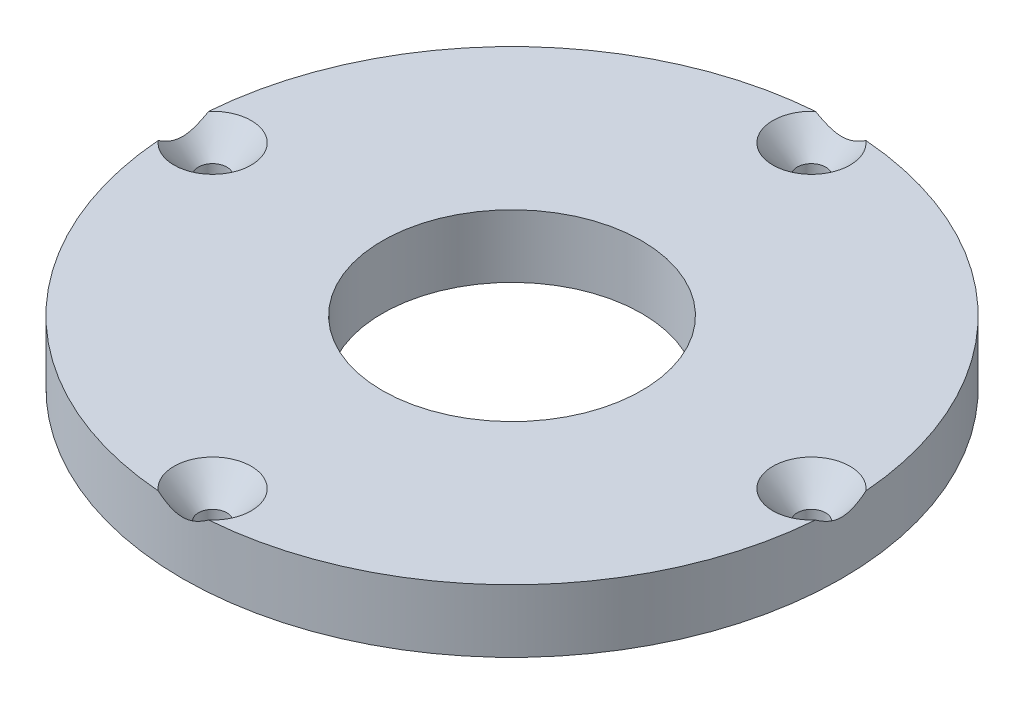
ISO-10303-21;
HEADER;
FILE_DESCRIPTION(('STEP AP214'),'2;1');
FILE_NAME('part.step','',(''),(''),'','','');
FILE_SCHEMA(('AUTOMOTIVE_DESIGN { 1 0 10303 214 1 1 1 1 }'));
ENDSEC;
DATA;
#1=APPLICATION_CONTEXT('core data for automotive mechanical design processes');
#2=APPLICATION_PROTOCOL_DEFINITION('international standard','automotive_design',2000,#1);
#3=PRODUCT_CONTEXT('',#1,'mechanical');
#4=PRODUCT('Part','Part','',(#3));
#5=PRODUCT_RELATED_PRODUCT_CATEGORY('part','',(#4));
#6=PRODUCT_DEFINITION_FORMATION('','',#4);
#7=PRODUCT_DEFINITION_CONTEXT('part definition',#1,'design');
#8=PRODUCT_DEFINITION('design','',#6,#7);
#9=PRODUCT_DEFINITION_SHAPE('','',#8);
#10=(LENGTH_UNIT() NAMED_UNIT(*) SI_UNIT(.MILLI.,.METRE.));
#11=(NAMED_UNIT(*) PLANE_ANGLE_UNIT() SI_UNIT($,.RADIAN.));
#12=(NAMED_UNIT(*) SI_UNIT($,.STERADIAN.) SOLID_ANGLE_UNIT());
#13=UNCERTAINTY_MEASURE_WITH_UNIT(LENGTH_MEASURE(1.E-05),#10,'distance_accuracy_value','');
#14=(GEOMETRIC_REPRESENTATION_CONTEXT(3) GLOBAL_UNCERTAINTY_ASSIGNED_CONTEXT((#13)) GLOBAL_UNIT_ASSIGNED_CONTEXT((#10,
#11,#12)) REPRESENTATION_CONTEXT('',''));
#15=CARTESIAN_POINT('',(0.,0.,0.));
#16=DIRECTION('',(0.,0.,1.));
#17=DIRECTION('',(1.,0.,0.));
#18=AXIS2_PLACEMENT_3D('',#15,#16,#17);
#19=CARTESIAN_POINT('',(0.,6.35,0.));
#20=DIRECTION('',(0.,-1.,0.));
#21=DIRECTION('',(0.,0.,-1.));
#22=AXIS2_PLACEMENT_3D('',#19,#20,#21);
#23=CYLINDRICAL_SURFACE('',#22,33.274);
#24=CARTESIAN_POINT('',(0.,6.35,0.));
#25=DIRECTION('',(0.,1.,0.));
#26=DIRECTION('',(0.,0.,1.));
#27=AXIS2_PLACEMENT_3D('',#24,#25,#26);
#28=CIRCLE('',#27,33.274);
#29=CARTESIAN_POINT('',(-33.1762180042017,6.35,2.5490458877165));
#30=VERTEX_POINT('',#29);
#31=CARTESIAN_POINT('',(-2.54904588771647,6.35,33.1762180042017));
#32=VERTEX_POINT('',#31);
#33=EDGE_CURVE('E66',#30,#32,#28,.T.);
#34=ORIENTED_EDGE('',*,*,#33,.F.);
#35=CARTESIAN_POINT('',(-33.1761955775648,6.3502,2.54933775698086));
#36=CARTESIAN_POINT('',(-33.1805825798049,6.31107939084975,2.49224353407827));
#37=CARTESIAN_POINT('',(-33.1848510304405,6.27250049597728,2.43476969254307));
#38=CARTESIAN_POINT('',(-33.1931441576657,6.19658644675497,2.31897186656584));
#39=CARTESIAN_POINT('',(-33.1971687808717,6.15925156556883,2.26064769939652));
#40=CARTESIAN_POINT('',(-33.2088943013344,6.04909511512583,2.08384553223999));
#41=CARTESIAN_POINT('',(-33.21621273273,5.97842751075451,1.96397900073564));
#42=CARTESIAN_POINT('',(-33.2299267423548,5.84287264009969,1.71662751721354));
#43=CARTESIAN_POINT('',(-33.2362915352426,5.77819684433707,1.58902380768307));
#44=CARTESIAN_POINT('',(-33.2477056933444,5.65973625813034,1.32892352336059));
#45=CARTESIAN_POINT('',(-33.252757166911,5.60593404296546,1.19643518556831));
#46=CARTESIAN_POINT('',(-33.2597607527403,5.53010959344534,0.97700011371498));
#47=CARTESIAN_POINT('',(-33.2621651774734,5.50373063278104,0.89157391111778));
#48=CARTESIAN_POINT('',(-33.2663443566313,5.45749882873885,0.718930100382252));
#49=CARTESIAN_POINT('',(-33.2681190973177,5.4376461277508,0.631712453202316));
#50=CARTESIAN_POINT('',(-33.2709765493234,5.40551094726472,0.456890129599175));
#51=CARTESIAN_POINT('',(-33.2720668907164,5.39314505771044,0.369301096688978));
#52=CARTESIAN_POINT('',(-33.2735544176201,5.3762413742042,0.193361047117015));
#53=CARTESIAN_POINT('',(-33.2739516632509,5.37170290129143,0.105010097213176));
#54=CARTESIAN_POINT('',(-33.2740401673081,5.37069333829633,-0.0720342768338496));
#55=CARTESIAN_POINT('',(-33.2737290643389,5.37424923209352,-0.160727859594178));
#56=CARTESIAN_POINT('',(-33.2724063706862,5.38929227282091,-0.337431416023773));
#57=CARTESIAN_POINT('',(-33.2713947189189,5.40078011136885,-0.425441329404433));
#58=CARTESIAN_POINT('',(-33.2686862677066,5.43128710485559,-0.601168319089554));
#59=CARTESIAN_POINT('',(-33.2669816807199,5.45039181327727,-0.688870240584589));
#60=CARTESIAN_POINT('',(-33.2629329615701,5.49527694915702,-0.862503889061059));
#61=CARTESIAN_POINT('',(-33.2605888461569,5.52105720177418,-0.94843566234128));
#62=CARTESIAN_POINT('',(-33.2536703765143,5.59615482408612,-1.17109467674494));
#63=CARTESIAN_POINT('',(-33.2486149947613,5.65014727225309,-1.30623006374369));
#64=CARTESIAN_POINT('',(-33.2371376661082,5.76954580051192,-1.5714421316998));
#65=CARTESIAN_POINT('',(-33.2307133355823,5.83497175250638,-1.70150951482053));
#66=CARTESIAN_POINT('',(-33.2168373397957,5.97236435376283,-1.9535315600519));
#67=CARTESIAN_POINT('',(-33.2094177537716,6.04410921552668,-2.07561016696838));
#68=CARTESIAN_POINT('',(-33.1975139212334,6.15604068896211,-2.25560127653234));
#69=CARTESIAN_POINT('',(-33.1934262548253,6.19398636529059,-2.3149562707655));
#70=CARTESIAN_POINT('',(-33.1849984365551,6.27116810514676,-2.43278419120686));
#71=CARTESIAN_POINT('',(-33.1806583435334,6.31040386703801,-2.49125731900659));
#72=CARTESIAN_POINT('',(-33.1761955775648,6.3502,-2.54933775698086));
#73=B_SPLINE_CURVE_WITH_KNOTS('',3,(#35,#36,#37,#38,#39,#40,#41,#42,#43,#44,#45,#46,#47,#48,#49,
#50,#51,#52,#53,#54,#55,#56,#57,#58,#59,#60,#61,#62,#63,#64,#65,#66,#67,#68,#69,#70,#71,#72),
.UNSPECIFIED.,.F.,.F.,(4,2,2,2,2,2,2,2,2,2,2,2,2,2,2,2,2,2,4),(0.,0.208043349461832,
0.416132084531599,0.833921512402195,1.26315987875748,1.69170484689115,1.95980491509329,
2.22791083231083,2.49297203327847,2.75801024131868,3.02393329047978,3.28987952945598,
3.55890108157153,3.82791558838638,4.26397379238092,4.70079756122368,5.12593596847389,
5.33762144708327,5.54925777837407),.UNSPECIFIED.);
#74=CARTESIAN_POINT('',(-33.1762180042017,6.35,-2.54904588771648));
#75=VERTEX_POINT('',#74);
#76=EDGE_CURVE('E11',#30,#75,#73,.T.);
#77=ORIENTED_EDGE('',*,*,#76,.T.);
#78=CARTESIAN_POINT('',(-2.5490458877165,6.35,-33.1762180042017));
#79=VERTEX_POINT('',#78);
#80=EDGE_CURVE('E90',#79,#75,#28,.T.);
#81=ORIENTED_EDGE('',*,*,#80,.F.);
#82=CARTESIAN_POINT('',(-2.54933775698085,6.3502,-33.1761955775648));
#83=CARTESIAN_POINT('',(-2.49224353407827,6.31107939084975,-33.1805825798049));
#84=CARTESIAN_POINT('',(-2.43476969254307,6.27250049597728,-33.1848510304405));
#85=CARTESIAN_POINT('',(-2.31897186656584,6.19658644675497,-33.1931441576657));
#86=CARTESIAN_POINT('',(-2.26064769939652,6.15925156556883,-33.1971687808717));
#87=CARTESIAN_POINT('',(-2.08384553223999,6.04909511512584,-33.2088943013344));
#88=CARTESIAN_POINT('',(-1.96397900073564,5.97842751075451,-33.21621273273));
#89=CARTESIAN_POINT('',(-1.71662751721354,5.84287264009969,-33.2299267423548));
#90=CARTESIAN_POINT('',(-1.58902380768307,5.77819684433707,-33.2362915352426));
#91=CARTESIAN_POINT('',(-1.32892352336059,5.65973625813034,-33.2477056933444));
#92=CARTESIAN_POINT('',(-1.19643518556831,5.60593404296546,-33.252757166911));
#93=CARTESIAN_POINT('',(-0.977000113714979,5.53010959344534,-33.2597607527403));
#94=CARTESIAN_POINT('',(-0.891573911117779,5.50373063278104,-33.2621651774734));
#95=CARTESIAN_POINT('',(-0.718930100382251,5.45749882873885,-33.2663443566313));
#96=CARTESIAN_POINT('',(-0.631712453202315,5.4376461277508,-33.2681190973177));
#97=CARTESIAN_POINT('',(-0.456890129599174,5.40551094726472,-33.2709765493234));
#98=CARTESIAN_POINT('',(-0.369301096688977,5.39314505771044,-33.2720668907164));
#99=CARTESIAN_POINT('',(-0.193361047117014,5.3762413742042,-33.2735544176201));
#100=CARTESIAN_POINT('',(-0.105010097213176,5.37170290129142,-33.2739516632509));
#101=CARTESIAN_POINT('',(0.0720342768338502,5.37069333829633,-33.2740401673081));
#102=CARTESIAN_POINT('',(0.160727859594178,5.37424923209353,-33.2737290643389));
#103=CARTESIAN_POINT('',(0.337431416023774,5.38929227282091,-33.2724063706862));
#104=CARTESIAN_POINT('',(0.425441329404434,5.40078011136885,-33.2713947189189));
#105=CARTESIAN_POINT('',(0.601168319089555,5.43128710485559,-33.2686862677066));
#106=CARTESIAN_POINT('',(0.68887024058459,5.45039181327727,-33.2669816807199));
#107=CARTESIAN_POINT('',(0.86250388906106,5.49527694915702,-33.2629329615701));
#108=CARTESIAN_POINT('',(0.948435662341281,5.52105720177418,-33.2605888461569));
#109=CARTESIAN_POINT('',(1.17109467674494,5.59615482408612,-33.2536703765143));
#110=CARTESIAN_POINT('',(1.30623006374369,5.65014727225309,-33.2486149947613));
#111=CARTESIAN_POINT('',(1.5714421316998,5.76954580051192,-33.2371376661082));
#112=CARTESIAN_POINT('',(1.70150951482053,5.83497175250639,-33.2307133355823));
#113=CARTESIAN_POINT('',(1.9535315600519,5.97236435376283,-33.2168373397957));
#114=CARTESIAN_POINT('',(2.07561016696838,6.04410921552668,-33.2094177537716));
#115=CARTESIAN_POINT('',(2.25560127653234,6.15604068896211,-33.1975139212334));
#116=CARTESIAN_POINT('',(2.3149562707655,6.19398636529059,-33.1934262548253));
#117=CARTESIAN_POINT('',(2.43278419120686,6.27116810514676,-33.1849984365551));
#118=CARTESIAN_POINT('',(2.49125731900659,6.31040386703801,-33.1806583435334));
#119=CARTESIAN_POINT('',(2.54933775698085,6.3502,-33.1761955775648));
#120=B_SPLINE_CURVE_WITH_KNOTS('',3,(#82,#83,#84,#85,#86,#87,#88,#89,#90,#91,#92,#93,#94,#95,
#96,#97,#98,#99,#100,#101,#102,#103,#104,#105,#106,#107,#108,#109,#110,#111,#112,#113,#114,#115,
#116,#117,#118,#119),.UNSPECIFIED.,.F.,.F.,(4,2,2,2,2,2,2,2,2,2,2,2,2,2,2,2,2,2,4),(0.,
0.208043349461831,0.416132084531599,0.833921512402194,1.26315987875747,1.69170484689115,
1.95980491509329,2.22791083231083,2.49297203327847,2.75801024131868,3.02393329047978,
3.28987952945598,3.55890108157154,3.82791558838638,4.26397379238092,4.70079756122368,
5.12593596847389,5.33762144708327,5.54925777837407),.UNSPECIFIED.);
#121=CARTESIAN_POINT('',(2.54904588771647,6.35,-33.1762180042017));
#122=VERTEX_POINT('',#121);
#123=EDGE_CURVE('E104',#79,#122,#120,.T.);
#124=ORIENTED_EDGE('',*,*,#123,.T.);
#125=CARTESIAN_POINT('',(33.1762180042017,6.35,-2.5490458877165));
#126=VERTEX_POINT('',#125);
#127=EDGE_CURVE('E105',#126,#122,#28,.T.);
#128=ORIENTED_EDGE('',*,*,#127,.F.);
#129=CARTESIAN_POINT('',(33.1761955775648,6.3502,-2.54933775698086));
#130=CARTESIAN_POINT('',(33.1805825798049,6.31107939084975,-2.49224353407827));
#131=CARTESIAN_POINT('',(33.1848510304405,6.27250049597728,-2.43476969254307));
#132=CARTESIAN_POINT('',(33.1931441576657,6.19658644675497,-2.31897186656584));
#133=CARTESIAN_POINT('',(33.1971687808717,6.15925156556883,-2.26064769939652));
#134=CARTESIAN_POINT('',(33.2088943013344,6.04909511512583,-2.08384553223999));
#135=CARTESIAN_POINT('',(33.21621273273,5.97842751075451,-1.96397900073564));
#136=CARTESIAN_POINT('',(33.2299267423548,5.84287264009969,-1.71662751721354));
#137=CARTESIAN_POINT('',(33.2362915352426,5.77819684433707,-1.58902380768307));
#138=CARTESIAN_POINT('',(33.2477056933444,5.65973625813034,-1.32892352336059));
#139=CARTESIAN_POINT('',(33.252757166911,5.60593404296546,-1.19643518556831));
#140=CARTESIAN_POINT('',(33.2597607527403,5.53010959344534,-0.97700011371498));
#141=CARTESIAN_POINT('',(33.2621651774734,5.50373063278104,-0.89157391111778));
#142=CARTESIAN_POINT('',(33.2663443566313,5.45749882873885,-0.718930100382252));
#143=CARTESIAN_POINT('',(33.2681190973177,5.4376461277508,-0.631712453202316));
#144=CARTESIAN_POINT('',(33.2709765493234,5.40551094726472,-0.456890129599175));
#145=CARTESIAN_POINT('',(33.2720668907164,5.39314505771044,-0.369301096688978));
#146=CARTESIAN_POINT('',(33.2735544176201,5.3762413742042,-0.193361047117015));
#147=CARTESIAN_POINT('',(33.2739516632509,5.37170290129143,-0.105010097213176));
#148=CARTESIAN_POINT('',(33.2740401673081,5.37069333829633,0.0720342768338496));
#149=CARTESIAN_POINT('',(33.2737290643389,5.37424923209352,0.160727859594178));
#150=CARTESIAN_POINT('',(33.2724063706862,5.38929227282091,0.337431416023773));
#151=CARTESIAN_POINT('',(33.2713947189189,5.40078011136885,0.425441329404433));
#152=CARTESIAN_POINT('',(33.2686862677066,5.43128710485559,0.601168319089554));
#153=CARTESIAN_POINT('',(33.2669816807199,5.45039181327727,0.688870240584589));
#154=CARTESIAN_POINT('',(33.2629329615701,5.49527694915702,0.862503889061059));
#155=CARTESIAN_POINT('',(33.2605888461569,5.52105720177418,0.94843566234128));
#156=CARTESIAN_POINT('',(33.2536703765143,5.59615482408612,1.17109467674494));
#157=CARTESIAN_POINT('',(33.2486149947613,5.65014727225309,1.30623006374369));
#158=CARTESIAN_POINT('',(33.2371376661082,5.76954580051192,1.5714421316998));
#159=CARTESIAN_POINT('',(33.2307133355823,5.83497175250638,1.70150951482053));
#160=CARTESIAN_POINT('',(33.2168373397957,5.97236435376283,1.9535315600519));
#161=CARTESIAN_POINT('',(33.2094177537716,6.04410921552668,2.07561016696838));
#162=CARTESIAN_POINT('',(33.1975139212334,6.15604068896211,2.25560127653234));
#163=CARTESIAN_POINT('',(33.1934262548253,6.19398636529059,2.3149562707655));
#164=CARTESIAN_POINT('',(33.1849984365551,6.27116810514676,2.43278419120686));
#165=CARTESIAN_POINT('',(33.1806583435334,6.31040386703801,2.49125731900659));
#166=CARTESIAN_POINT('',(33.1761955775648,6.3502,2.54933775698086));
#167=B_SPLINE_CURVE_WITH_KNOTS('',3,(#129,#130,#131,#132,#133,#134,#135,#136,#137,#138,#139,
#140,#141,#142,#143,#144,#145,#146,#147,#148,#149,#150,#151,#152,#153,#154,#155,#156,#157,#158,
#159,#160,#161,#162,#163,#164,#165,#166),.UNSPECIFIED.,.F.,.F.,(4,2,2,2,2,2,2,2,2,2,2,2,2,2,2,2,
2,2,4),(0.,0.208043349461832,0.416132084531599,0.833921512402195,1.26315987875748,
1.69170484689115,1.95980491509329,2.22791083231083,2.49297203327847,2.75801024131868,
3.02393329047978,3.28987952945598,3.55890108157153,3.82791558838638,4.26397379238092,
4.70079756122368,5.12593596847389,5.33762144708327,5.54925777837407),.UNSPECIFIED.);
#168=CARTESIAN_POINT('',(33.1762180042017,6.35,2.54904588771648));
#169=VERTEX_POINT('',#168);
#170=EDGE_CURVE('E123',#126,#169,#167,.T.);
#171=ORIENTED_EDGE('',*,*,#170,.T.);
#172=CARTESIAN_POINT('',(2.5490458877165,6.35,33.1762180042017));
#173=VERTEX_POINT('',#172);
#174=EDGE_CURVE('E99',#173,#169,#28,.T.);
#175=ORIENTED_EDGE('',*,*,#174,.F.);
#176=CARTESIAN_POINT('',(2.54933775698085,6.3502,33.1761955775648));
#177=CARTESIAN_POINT('',(2.49224353407827,6.31107939084975,33.1805825798049));
#178=CARTESIAN_POINT('',(2.43476969254307,6.27250049597728,33.1848510304405));
#179=CARTESIAN_POINT('',(2.31897186656584,6.19658644675497,33.1931441576657));
#180=CARTESIAN_POINT('',(2.26064769939652,6.15925156556883,33.1971687808717));
#181=CARTESIAN_POINT('',(2.08384553223999,6.04909511512584,33.2088943013344));
#182=CARTESIAN_POINT('',(1.96397900073564,5.97842751075451,33.21621273273));
#183=CARTESIAN_POINT('',(1.71662751721354,5.84287264009969,33.2299267423548));
#184=CARTESIAN_POINT('',(1.58902380768307,5.77819684433707,33.2362915352426));
#185=CARTESIAN_POINT('',(1.32892352336059,5.65973625813034,33.2477056933444));
#186=CARTESIAN_POINT('',(1.19643518556831,5.60593404296546,33.252757166911));
#187=CARTESIAN_POINT('',(0.977000113714979,5.53010959344534,33.2597607527403));
#188=CARTESIAN_POINT('',(0.891573911117779,5.50373063278104,33.2621651774734));
#189=CARTESIAN_POINT('',(0.718930100382251,5.45749882873885,33.2663443566313));
#190=CARTESIAN_POINT('',(0.631712453202315,5.4376461277508,33.2681190973177));
#191=CARTESIAN_POINT('',(0.456890129599174,5.40551094726472,33.2709765493234));
#192=CARTESIAN_POINT('',(0.369301096688977,5.39314505771044,33.2720668907164));
#193=CARTESIAN_POINT('',(0.193361047117014,5.3762413742042,33.2735544176201));
#194=CARTESIAN_POINT('',(0.105010097213176,5.37170290129142,33.2739516632509));
#195=CARTESIAN_POINT('',(-0.0720342768338502,5.37069333829633,33.2740401673081));
#196=CARTESIAN_POINT('',(-0.160727859594178,5.37424923209353,33.2737290643389));
#197=CARTESIAN_POINT('',(-0.337431416023774,5.38929227282091,33.2724063706862));
#198=CARTESIAN_POINT('',(-0.425441329404434,5.40078011136885,33.2713947189189));
#199=CARTESIAN_POINT('',(-0.601168319089555,5.43128710485559,33.2686862677066));
#200=CARTESIAN_POINT('',(-0.68887024058459,5.45039181327727,33.2669816807199));
#201=CARTESIAN_POINT('',(-0.86250388906106,5.49527694915702,33.2629329615701));
#202=CARTESIAN_POINT('',(-0.948435662341281,5.52105720177418,33.2605888461569));
#203=CARTESIAN_POINT('',(-1.17109467674494,5.59615482408612,33.2536703765143));
#204=CARTESIAN_POINT('',(-1.30623006374369,5.65014727225309,33.2486149947613));
#205=CARTESIAN_POINT('',(-1.5714421316998,5.76954580051192,33.2371376661082));
#206=CARTESIAN_POINT('',(-1.70150951482053,5.83497175250639,33.2307133355823));
#207=CARTESIAN_POINT('',(-1.9535315600519,5.97236435376283,33.2168373397957));
#208=CARTESIAN_POINT('',(-2.07561016696838,6.04410921552668,33.2094177537716));
#209=CARTESIAN_POINT('',(-2.25560127653234,6.15604068896211,33.1975139212334));
#210=CARTESIAN_POINT('',(-2.3149562707655,6.19398636529059,33.1934262548253));
#211=CARTESIAN_POINT('',(-2.43278419120686,6.27116810514676,33.1849984365551));
#212=CARTESIAN_POINT('',(-2.49125731900659,6.31040386703801,33.1806583435334));
#213=CARTESIAN_POINT('',(-2.54933775698085,6.3502,33.1761955775648));
#214=B_SPLINE_CURVE_WITH_KNOTS('',3,(#176,#177,#178,#179,#180,#181,#182,#183,#184,#185,#186,
#187,#188,#189,#190,#191,#192,#193,#194,#195,#196,#197,#198,#199,#200,#201,#202,#203,#204,#205,
#206,#207,#208,#209,#210,#211,#212,#213),.UNSPECIFIED.,.F.,.F.,(4,2,2,2,2,2,2,2,2,2,2,2,2,2,2,2,
2,2,4),(0.,0.208043349461831,0.416132084531599,0.833921512402194,1.26315987875747,
1.69170484689115,1.95980491509329,2.22791083231083,2.49297203327847,2.75801024131868,
3.02393329047978,3.28987952945598,3.55890108157154,3.82791558838638,4.26397379238092,
4.70079756122368,5.12593596847389,5.33762144708327,5.54925777837407),.UNSPECIFIED.);
#215=EDGE_CURVE('E54',#173,#32,#214,.T.);
#216=ORIENTED_EDGE('',*,*,#215,.T.);
#217=EDGE_LOOP('',(#34,#77,#81,#124,#128,#171,#175,#216));
#218=FACE_BOUND('',#217,.T.);
#219=CARTESIAN_POINT('',(0.,0.,0.));
#220=DIRECTION('',(0.,1.,0.));
#221=DIRECTION('',(0.,0.,1.));
#222=AXIS2_PLACEMENT_3D('',#219,#220,#221);
#223=CIRCLE('',#222,33.274);
#224=CARTESIAN_POINT('',(0.,0.,33.274));
#225=VERTEX_POINT('',#224);
#226=EDGE_CURVE('E110',#225,#225,#223,.T.);
#227=ORIENTED_EDGE('',*,*,#226,.T.);
#228=EDGE_LOOP('',(#227));
#229=FACE_BOUND('',#228,.T.);
#230=ADVANCED_FACE('F44',(#218,#229),#23,.T.);
#231=CARTESIAN_POINT('',(0.,6.35,0.));
#232=DIRECTION('',(0.,1.,0.));
#233=DIRECTION('',(0.,0.,1.));
#234=AXIS2_PLACEMENT_3D('',#231,#232,#233);
#235=PLANE('',#234);
#236=CARTESIAN_POINT('',(0.,6.35,0.));
#237=DIRECTION('',(0.,1.,0.));
#238=DIRECTION('',(0.,0.,1.));
#239=AXIS2_PLACEMENT_3D('',#236,#237,#238);
#240=CIRCLE('',#239,13.096875);
#241=CARTESIAN_POINT('',(0.,6.35,13.096875));
#242=VERTEX_POINT('',#241);
#243=EDGE_CURVE('E374',#242,#242,#240,.T.);
#244=ORIENTED_EDGE('',*,*,#243,.F.);
#245=EDGE_LOOP('',(#244));
#246=FACE_BOUND('',#245,.T.);
#247=CARTESIAN_POINT('',(-30.226,6.35,0.));
#248=DIRECTION('',(0.,1.,0.));
#249=DIRECTION('',(0.,0.,1.));
#250=AXIS2_PLACEMENT_3D('',#247,#248,#249);
#251=CIRCLE('',#250,3.8989);
#252=EDGE_CURVE('E60',#30,#75,#251,.T.);
#253=ORIENTED_EDGE('',*,*,#252,.F.);
#254=ORIENTED_EDGE('',*,*,#33,.T.);
#255=CARTESIAN_POINT('',(0.,6.35,30.226));
#256=DIRECTION('',(0.,1.,0.));
#257=DIRECTION('',(0.,0.,1.));
#258=AXIS2_PLACEMENT_3D('',#255,#256,#257);
#259=CIRCLE('',#258,3.8989);
#260=EDGE_CURVE('E361',#173,#32,#259,.T.);
#261=ORIENTED_EDGE('',*,*,#260,.F.);
#262=ORIENTED_EDGE('',*,*,#174,.T.);
#263=CARTESIAN_POINT('',(30.226,6.35,0.));
#264=DIRECTION('',(0.,1.,0.));
#265=DIRECTION('',(0.,0.,1.));
#266=AXIS2_PLACEMENT_3D('',#263,#264,#265);
#267=CIRCLE('',#266,3.8989);
#268=EDGE_CURVE('E329',#126,#169,#267,.T.);
#269=ORIENTED_EDGE('',*,*,#268,.F.);
#270=ORIENTED_EDGE('',*,*,#127,.T.);
#271=CARTESIAN_POINT('',(0.,6.35,-30.226));
#272=DIRECTION('',(0.,1.,0.));
#273=DIRECTION('',(0.,0.,1.));
#274=AXIS2_PLACEMENT_3D('',#271,#272,#273);
#275=CIRCLE('',#274,3.8989);
#276=EDGE_CURVE('E322',#79,#122,#275,.T.);
#277=ORIENTED_EDGE('',*,*,#276,.F.);
#278=ORIENTED_EDGE('',*,*,#80,.T.);
#279=EDGE_LOOP('',(#253,#254,#261,#262,#269,#270,#277,#278));
#280=FACE_BOUND('',#279,.T.);
#281=ADVANCED_FACE('F88',(#246,#280),#235,.T.);
#282=CARTESIAN_POINT('',(0.,0.,0.));
#283=DIRECTION('',(0.,1.,0.));
#284=DIRECTION('',(0.,0.,1.));
#285=AXIS2_PLACEMENT_3D('',#282,#283,#284);
#286=PLANE('',#285);
#287=CARTESIAN_POINT('',(0.,0.,0.));
#288=DIRECTION('',(0.,1.,0.));
#289=DIRECTION('',(0.,0.,1.));
#290=AXIS2_PLACEMENT_3D('',#287,#288,#289);
#291=CIRCLE('',#290,13.096875);
#292=CARTESIAN_POINT('',(0.,0.,13.096875));
#293=VERTEX_POINT('',#292);
#294=EDGE_CURVE('E93',#293,#293,#291,.T.);
#295=ORIENTED_EDGE('',*,*,#294,.T.);
#296=EDGE_LOOP('',(#295));
#297=FACE_BOUND('',#296,.T.);
#298=CARTESIAN_POINT('',(-30.226,0.,0.));
#299=DIRECTION('',(0.,1.,0.));
#300=DIRECTION('',(0.,0.,1.));
#301=AXIS2_PLACEMENT_3D('',#298,#299,#300);
#302=CIRCLE('',#301,1.43509999999999);
#303=CARTESIAN_POINT('',(-30.226,0.,1.43509999999999));
#304=VERTEX_POINT('',#303);
#305=EDGE_CURVE('E48',#304,#304,#302,.T.);
#306=ORIENTED_EDGE('',*,*,#305,.T.);
#307=EDGE_LOOP('',(#306));
#308=FACE_BOUND('',#307,.T.);
#309=CARTESIAN_POINT('',(0.,0.,30.226));
#310=DIRECTION('',(0.,1.,0.));
#311=DIRECTION('',(0.,0.,1.));
#312=AXIS2_PLACEMENT_3D('',#309,#310,#311);
#313=CIRCLE('',#312,1.43509999999999);
#314=CARTESIAN_POINT('',(0.,0.,31.6611));
#315=VERTEX_POINT('',#314);
#316=EDGE_CURVE('E342',#315,#315,#313,.T.);
#317=ORIENTED_EDGE('',*,*,#316,.T.);
#318=EDGE_LOOP('',(#317));
#319=FACE_BOUND('',#318,.T.);
#320=CARTESIAN_POINT('',(30.226,0.,0.));
#321=DIRECTION('',(0.,1.,0.));
#322=DIRECTION('',(0.,0.,1.));
#323=AXIS2_PLACEMENT_3D('',#320,#321,#322);
#324=CIRCLE('',#323,1.43509999999999);
#325=CARTESIAN_POINT('',(30.226,0.,1.43509999999999));
#326=VERTEX_POINT('',#325);
#327=EDGE_CURVE('E319',#326,#326,#324,.T.);
#328=ORIENTED_EDGE('',*,*,#327,.T.);
#329=EDGE_LOOP('',(#328));
#330=FACE_BOUND('',#329,.T.);
#331=CARTESIAN_POINT('',(0.,0.,-30.226));
#332=DIRECTION('',(0.,1.,0.));
#333=DIRECTION('',(0.,0.,1.));
#334=AXIS2_PLACEMENT_3D('',#331,#332,#333);
#335=CIRCLE('',#334,1.43509999999999);
#336=CARTESIAN_POINT('',(0.,0.,-28.7909));
#337=VERTEX_POINT('',#336);
#338=EDGE_CURVE('E114',#337,#337,#335,.T.);
#339=ORIENTED_EDGE('',*,*,#338,.T.);
#340=EDGE_LOOP('',(#339));
#341=FACE_BOUND('',#340,.T.);
#342=ORIENTED_EDGE('',*,*,#226,.F.);
#343=EDGE_LOOP('',(#342));
#344=FACE_BOUND('',#343,.T.);
#345=ADVANCED_FACE('F136',(#297,#308,#319,#330,#341,#344),#286,.F.);
#346=CARTESIAN_POINT('',(0.,6.35,-30.226));
#347=DIRECTION('',(0.,1.,0.));
#348=DIRECTION('',(0.,0.,1.));
#349=AXIS2_PLACEMENT_3D('',#346,#347,#348);
#350=CYLINDRICAL_SURFACE('',#349,1.43509999999999);
#351=CARTESIAN_POINT('',(0.,3.51572231828888,-30.226));
#352=DIRECTION('',(0.,1.,0.));
#353=DIRECTION('',(0.,0.,1.));
#354=AXIS2_PLACEMENT_3D('',#351,#352,#353);
#355=CIRCLE('',#354,1.4351);
#356=CARTESIAN_POINT('',(0.,3.51572231828888,-28.7909));
#357=VERTEX_POINT('',#356);
#358=EDGE_CURVE('E108',#357,#357,#355,.T.);
#359=ORIENTED_EDGE('',*,*,#358,.T.);
#360=EDGE_LOOP('',(#359));
#361=FACE_BOUND('',#360,.T.);
#362=ORIENTED_EDGE('',*,*,#338,.F.);
#363=EDGE_LOOP('',(#362));
#364=FACE_BOUND('',#363,.T.);
#365=ADVANCED_FACE('F131',(#361,#364),#350,.F.);
#366=CARTESIAN_POINT('',(0.,6.35,-30.226));
#367=DIRECTION('',(0.,1.,0.));
#368=DIRECTION('',(0.,0.,1.));
#369=AXIS2_PLACEMENT_3D('',#366,#367,#368);
#370=CONICAL_SURFACE('',#369,3.8989,0.715584993317676);
#371=ORIENTED_EDGE('',*,*,#358,.F.);
#372=EDGE_LOOP('',(#371));
#373=FACE_BOUND('',#372,.T.);
#374=ORIENTED_EDGE('',*,*,#276,.T.);
#375=ORIENTED_EDGE('',*,*,#123,.F.);
#376=EDGE_LOOP('',(#374,#375));
#377=FACE_BOUND('',#376,.T.);
#378=ADVANCED_FACE('F125',(#373,#377),#370,.F.);
#379=CARTESIAN_POINT('',(30.226,6.35,0.));
#380=DIRECTION('',(0.,1.,0.));
#381=DIRECTION('',(0.,0.,1.));
#382=AXIS2_PLACEMENT_3D('',#379,#380,#381);
#383=CYLINDRICAL_SURFACE('',#382,1.43509999999999);
#384=CARTESIAN_POINT('',(30.226,3.51572231828888,0.));
#385=DIRECTION('',(0.,1.,0.));
#386=DIRECTION('',(0.,0.,1.));
#387=AXIS2_PLACEMENT_3D('',#384,#385,#386);
#388=CIRCLE('',#387,1.4351);
#389=CARTESIAN_POINT('',(30.226,3.51572231828888,1.4351));
#390=VERTEX_POINT('',#389);
#391=EDGE_CURVE('E316',#390,#390,#388,.T.);
#392=ORIENTED_EDGE('',*,*,#391,.T.);
#393=EDGE_LOOP('',(#392));
#394=FACE_BOUND('',#393,.T.);
#395=ORIENTED_EDGE('',*,*,#327,.F.);
#396=EDGE_LOOP('',(#395));
#397=FACE_BOUND('',#396,.T.);
#398=ADVANCED_FACE('F130',(#394,#397),#383,.F.);
#399=CARTESIAN_POINT('',(30.226,6.35,0.));
#400=DIRECTION('',(0.,1.,0.));
#401=DIRECTION('',(0.,0.,1.));
#402=AXIS2_PLACEMENT_3D('',#399,#400,#401);
#403=CONICAL_SURFACE('',#402,3.8989,0.715584993317676);
#404=ORIENTED_EDGE('',*,*,#391,.F.);
#405=EDGE_LOOP('',(#404));
#406=FACE_BOUND('',#405,.T.);
#407=ORIENTED_EDGE('',*,*,#268,.T.);
#408=ORIENTED_EDGE('',*,*,#170,.F.);
#409=EDGE_LOOP('',(#407,#408));
#410=FACE_BOUND('',#409,.T.);
#411=ADVANCED_FACE('F172',(#406,#410),#403,.F.);
#412=CARTESIAN_POINT('',(0.,6.35,30.226));
#413=DIRECTION('',(0.,1.,0.));
#414=DIRECTION('',(0.,0.,1.));
#415=AXIS2_PLACEMENT_3D('',#412,#413,#414);
#416=CYLINDRICAL_SURFACE('',#415,1.43509999999999);
#417=CARTESIAN_POINT('',(0.,3.51572231828888,30.226));
#418=DIRECTION('',(0.,1.,0.));
#419=DIRECTION('',(0.,0.,1.));
#420=AXIS2_PLACEMENT_3D('',#417,#418,#419);
#421=CIRCLE('',#420,1.4351);
#422=CARTESIAN_POINT('',(0.,3.51572231828888,31.6611));
#423=VERTEX_POINT('',#422);
#424=EDGE_CURVE('E352',#423,#423,#421,.T.);
#425=ORIENTED_EDGE('',*,*,#424,.T.);
#426=EDGE_LOOP('',(#425));
#427=FACE_BOUND('',#426,.T.);
#428=ORIENTED_EDGE('',*,*,#316,.F.);
#429=EDGE_LOOP('',(#428));
#430=FACE_BOUND('',#429,.T.);
#431=ADVANCED_FACE('F176',(#427,#430),#416,.F.);
#432=CARTESIAN_POINT('',(0.,6.35,30.226));
#433=DIRECTION('',(0.,1.,0.));
#434=DIRECTION('',(0.,0.,1.));
#435=AXIS2_PLACEMENT_3D('',#432,#433,#434);
#436=CONICAL_SURFACE('',#435,3.8989,0.715584993317676);
#437=ORIENTED_EDGE('',*,*,#424,.F.);
#438=EDGE_LOOP('',(#437));
#439=FACE_BOUND('',#438,.T.);
#440=ORIENTED_EDGE('',*,*,#260,.T.);
#441=ORIENTED_EDGE('',*,*,#215,.F.);
#442=EDGE_LOOP('',(#440,#441));
#443=FACE_BOUND('',#442,.T.);
#444=ADVANCED_FACE('F183',(#439,#443),#436,.F.);
#445=CARTESIAN_POINT('',(-30.226,6.35,0.));
#446=DIRECTION('',(0.,1.,0.));
#447=DIRECTION('',(0.,0.,1.));
#448=AXIS2_PLACEMENT_3D('',#445,#446,#447);
#449=CYLINDRICAL_SURFACE('',#448,1.43509999999999);
#450=CARTESIAN_POINT('',(-30.226,3.51572231828888,0.));
#451=DIRECTION('',(0.,1.,0.));
#452=DIRECTION('',(0.,0.,1.));
#453=AXIS2_PLACEMENT_3D('',#450,#451,#452);
#454=CIRCLE('',#453,1.4351);
#455=CARTESIAN_POINT('',(-30.226,3.51572231828888,1.4351));
#456=VERTEX_POINT('',#455);
#457=EDGE_CURVE('E92',#456,#456,#454,.T.);
#458=ORIENTED_EDGE('',*,*,#457,.T.);
#459=EDGE_LOOP('',(#458));
#460=FACE_BOUND('',#459,.T.);
#461=ORIENTED_EDGE('',*,*,#305,.F.);
#462=EDGE_LOOP('',(#461));
#463=FACE_BOUND('',#462,.T.);
#464=ADVANCED_FACE('F187',(#460,#463),#449,.F.);
#465=CARTESIAN_POINT('',(-30.226,6.35,0.));
#466=DIRECTION('',(0.,1.,0.));
#467=DIRECTION('',(0.,0.,1.));
#468=AXIS2_PLACEMENT_3D('',#465,#466,#467);
#469=CONICAL_SURFACE('',#468,3.8989,0.715584993317676);
#470=ORIENTED_EDGE('',*,*,#457,.F.);
#471=EDGE_LOOP('',(#470));
#472=FACE_BOUND('',#471,.T.);
#473=ORIENTED_EDGE('',*,*,#252,.T.);
#474=ORIENTED_EDGE('',*,*,#76,.F.);
#475=EDGE_LOOP('',(#473,#474));
#476=FACE_BOUND('',#475,.T.);
#477=ADVANCED_FACE('F84',(#472,#476),#469,.F.);
#478=CARTESIAN_POINT('',(0.,6.35,0.));
#479=DIRECTION('',(0.,1.,0.));
#480=DIRECTION('',(0.,0.,1.));
#481=AXIS2_PLACEMENT_3D('',#478,#479,#480);
#482=CYLINDRICAL_SURFACE('',#481,13.096875);
#483=ORIENTED_EDGE('',*,*,#294,.F.);
#484=EDGE_LOOP('',(#483));
#485=FACE_BOUND('',#484,.T.);
#486=ORIENTED_EDGE('',*,*,#243,.T.);
#487=EDGE_LOOP('',(#486));
#488=FACE_BOUND('',#487,.T.);
#489=ADVANCED_FACE('F198',(#485,#488),#482,.F.);
#490=CLOSED_SHELL('',(#230,#281,#345,#365,#378,#398,#411,#431,#444,#464,#477,#489));
#491=MANIFOLD_SOLID_BREP('B2',#490);
#492=ADVANCED_BREP_SHAPE_REPRESENTATION('',(#18,#491),#14);
#493=SHAPE_DEFINITION_REPRESENTATION(#9,#492);
ENDSEC;
END-ISO-10303-21;
